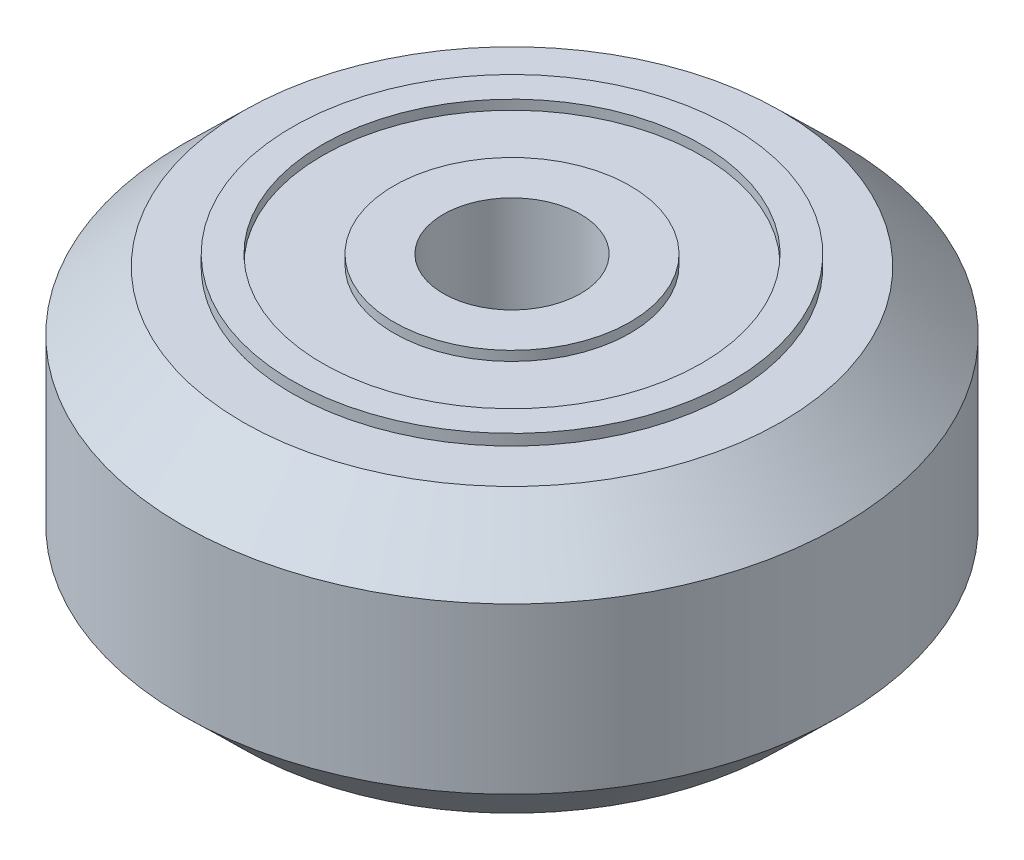
ISO-10303-21;
HEADER;
FILE_DESCRIPTION(('STEP AP214'),'2;1');
FILE_NAME('part.step','',(''),(''),'','','');
FILE_SCHEMA(('AUTOMOTIVE_DESIGN { 1 0 10303 214 1 1 1 1 }'));
ENDSEC;
DATA;
#1=APPLICATION_CONTEXT('core data for automotive mechanical design processes');
#2=APPLICATION_PROTOCOL_DEFINITION('international standard','automotive_design',2000,#1);
#3=PRODUCT_CONTEXT('',#1,'mechanical');
#4=PRODUCT('Part','Part','',(#3));
#5=PRODUCT_RELATED_PRODUCT_CATEGORY('part','',(#4));
#6=PRODUCT_DEFINITION_FORMATION('','',#4);
#7=PRODUCT_DEFINITION_CONTEXT('part definition',#1,'design');
#8=PRODUCT_DEFINITION('design','',#6,#7);
#9=PRODUCT_DEFINITION_SHAPE('','',#8);
#10=(LENGTH_UNIT() NAMED_UNIT(*) SI_UNIT(.MILLI.,.METRE.));
#11=(NAMED_UNIT(*) PLANE_ANGLE_UNIT() SI_UNIT($,.RADIAN.));
#12=(NAMED_UNIT(*) SI_UNIT($,.STERADIAN.) SOLID_ANGLE_UNIT());
#13=UNCERTAINTY_MEASURE_WITH_UNIT(LENGTH_MEASURE(1.E-05),#10,'distance_accuracy_value','');
#14=(GEOMETRIC_REPRESENTATION_CONTEXT(3) GLOBAL_UNCERTAINTY_ASSIGNED_CONTEXT((#13)) GLOBAL_UNIT_ASSIGNED_CONTEXT((#10,
#11,#12)) REPRESENTATION_CONTEXT('',''));
#15=CARTESIAN_POINT('',(0.,0.,0.));
#16=DIRECTION('',(0.,0.,1.));
#17=DIRECTION('',(1.,0.,0.));
#18=AXIS2_PLACEMENT_3D('',#15,#16,#17);
#19=CARTESIAN_POINT('',(0.,-5.55,-8.));
#20=DIRECTION('',(0.,1.,0.));
#21=DIRECTION('',(1.,0.,0.));
#22=AXIS2_PLACEMENT_3D('',#19,#20,#21);
#23=PLANE('',#22);
#24=CARTESIAN_POINT('',(0.,-5.55,0.));
#25=DIRECTION('',(0.,1.,0.));
#26=DIRECTION('',(1.,0.,0.));
#27=AXIS2_PLACEMENT_3D('',#24,#25,#26);
#28=CIRCLE('',#27,8.);
#29=CARTESIAN_POINT('',(8.,-5.55,0.));
#30=VERTEX_POINT('',#29);
#31=EDGE_CURVE('P0_E54',#30,#30,#28,.T.);
#32=ORIENTED_EDGE('',*,*,#31,.F.);
#33=EDGE_LOOP('',(#32));
#34=FACE_BOUND('',#33,.T.);
#35=CARTESIAN_POINT('',(0.,-5.55,0.));
#36=DIRECTION('',(0.,1.,0.));
#37=DIRECTION('',(1.,0.,0.));
#38=AXIS2_PLACEMENT_3D('',#35,#36,#37);
#39=CIRCLE('',#38,6.9);
#40=CARTESIAN_POINT('',(6.9,-5.55,0.));
#41=VERTEX_POINT('',#40);
#42=EDGE_CURVE('P0_E9',#41,#41,#39,.T.);
#43=ORIENTED_EDGE('',*,*,#42,.T.);
#44=EDGE_LOOP('',(#43));
#45=FACE_BOUND('',#44,.T.);
#46=ADVANCED_FACE('P0_F14',(#34,#45),#23,.F.);
#47=CARTESIAN_POINT('',(0.,8.97867383512545,0.));
#48=DIRECTION('',(0.,1.,0.));
#49=DIRECTION('',(1.,0.,0.));
#50=AXIS2_PLACEMENT_3D('',#47,#48,#49);
#51=CYLINDRICAL_SURFACE('',#50,6.9);
#52=ORIENTED_EDGE('',*,*,#42,.F.);
#53=EDGE_LOOP('',(#52));
#54=FACE_BOUND('',#53,.T.);
#55=CARTESIAN_POINT('',(0.,-5.2,0.));
#56=DIRECTION('',(0.,1.,0.));
#57=DIRECTION('',(1.,0.,0.));
#58=AXIS2_PLACEMENT_3D('',#55,#56,#57);
#59=CIRCLE('',#58,6.9);
#60=CARTESIAN_POINT('',(6.9,-5.2,0.));
#61=VERTEX_POINT('',#60);
#62=EDGE_CURVE('P0_E20',#61,#61,#59,.T.);
#63=ORIENTED_EDGE('',*,*,#62,.T.);
#64=EDGE_LOOP('',(#63));
#65=FACE_BOUND('',#64,.T.);
#66=ADVANCED_FACE('P0_F61',(#54,#65),#51,.F.);
#67=CARTESIAN_POINT('',(0.,-5.2,-6.9));
#68=DIRECTION('',(0.,1.,0.));
#69=DIRECTION('',(1.,0.,0.));
#70=AXIS2_PLACEMENT_3D('',#67,#68,#69);
#71=PLANE('',#70);
#72=ORIENTED_EDGE('',*,*,#62,.F.);
#73=EDGE_LOOP('',(#72));
#74=FACE_BOUND('',#73,.T.);
#75=CARTESIAN_POINT('',(0.,-5.2,0.));
#76=DIRECTION('',(0.,1.,0.));
#77=DIRECTION('',(1.,0.,0.));
#78=AXIS2_PLACEMENT_3D('',#75,#76,#77);
#79=CIRCLE('',#78,4.3);
#80=CARTESIAN_POINT('',(4.3,-5.2,0.));
#81=VERTEX_POINT('',#80);
#82=EDGE_CURVE('P0_E24',#81,#81,#79,.T.);
#83=ORIENTED_EDGE('',*,*,#82,.T.);
#84=EDGE_LOOP('',(#83));
#85=FACE_BOUND('',#84,.T.);
#86=ADVANCED_FACE('P0_F66',(#74,#85),#71,.F.);
#87=CARTESIAN_POINT('',(0.,8.97867383512545,0.));
#88=DIRECTION('',(0.,1.,0.));
#89=DIRECTION('',(1.,0.,0.));
#90=AXIS2_PLACEMENT_3D('',#87,#88,#89);
#91=CYLINDRICAL_SURFACE('',#90,4.3);
#92=ORIENTED_EDGE('',*,*,#82,.F.);
#93=EDGE_LOOP('',(#92));
#94=FACE_BOUND('',#93,.T.);
#95=CARTESIAN_POINT('',(0.,-5.55,0.));
#96=DIRECTION('',(0.,1.,0.));
#97=DIRECTION('',(1.,0.,0.));
#98=AXIS2_PLACEMENT_3D('',#95,#96,#97);
#99=CIRCLE('',#98,4.3);
#100=CARTESIAN_POINT('',(4.3,-5.55,0.));
#101=VERTEX_POINT('',#100);
#102=EDGE_CURVE('P0_E28',#101,#101,#99,.T.);
#103=ORIENTED_EDGE('',*,*,#102,.T.);
#104=EDGE_LOOP('',(#103));
#105=FACE_BOUND('',#104,.T.);
#106=ADVANCED_FACE('P0_F71',(#94,#105),#91,.T.);
#107=CARTESIAN_POINT('',(0.,-5.55,-4.3));
#108=DIRECTION('',(0.,1.,0.));
#109=DIRECTION('',(1.,0.,0.));
#110=AXIS2_PLACEMENT_3D('',#107,#108,#109);
#111=PLANE('',#110);
#112=ORIENTED_EDGE('',*,*,#102,.F.);
#113=EDGE_LOOP('',(#112));
#114=FACE_BOUND('',#113,.T.);
#115=CARTESIAN_POINT('',(0.,-5.55,0.));
#116=DIRECTION('',(0.,1.,0.));
#117=DIRECTION('',(1.,0.,0.));
#118=AXIS2_PLACEMENT_3D('',#115,#116,#117);
#119=CIRCLE('',#118,2.5);
#120=CARTESIAN_POINT('',(2.5,-5.55,0.));
#121=VERTEX_POINT('',#120);
#122=EDGE_CURVE('P0_E33',#121,#121,#119,.T.);
#123=ORIENTED_EDGE('',*,*,#122,.T.);
#124=EDGE_LOOP('',(#123));
#125=FACE_BOUND('',#124,.T.);
#126=ADVANCED_FACE('P0_F77',(#114,#125),#111,.F.);
#127=CARTESIAN_POINT('',(0.,8.97867383512545,0.));
#128=DIRECTION('',(0.,1.,0.));
#129=DIRECTION('',(1.,0.,0.));
#130=AXIS2_PLACEMENT_3D('',#127,#128,#129);
#131=CYLINDRICAL_SURFACE('',#130,2.5);
#132=ORIENTED_EDGE('',*,*,#122,.F.);
#133=EDGE_LOOP('',(#132));
#134=FACE_BOUND('',#133,.T.);
#135=CARTESIAN_POINT('',(0.,-0.55,0.));
#136=DIRECTION('',(0.,1.,0.));
#137=DIRECTION('',(1.,0.,0.));
#138=AXIS2_PLACEMENT_3D('',#135,#136,#137);
#139=CIRCLE('',#138,2.5);
#140=CARTESIAN_POINT('',(2.5,-0.55,0.));
#141=VERTEX_POINT('',#140);
#142=EDGE_CURVE('P0_E36',#141,#141,#139,.T.);
#143=ORIENTED_EDGE('',*,*,#142,.T.);
#144=EDGE_LOOP('',(#143));
#145=FACE_BOUND('',#144,.T.);
#146=ADVANCED_FACE('P0_F81',(#134,#145),#131,.F.);
#147=CARTESIAN_POINT('',(0.,-0.549999999999999,-4.3));
#148=DIRECTION('',(0.,-1.,0.));
#149=DIRECTION('',(-1.,0.,0.));
#150=AXIS2_PLACEMENT_3D('',#147,#148,#149);
#151=PLANE('',#150);
#152=ORIENTED_EDGE('',*,*,#142,.F.);
#153=EDGE_LOOP('',(#152));
#154=FACE_BOUND('',#153,.T.);
#155=CARTESIAN_POINT('',(0.,-0.55,0.));
#156=DIRECTION('',(0.,1.,0.));
#157=DIRECTION('',(1.,0.,0.));
#158=AXIS2_PLACEMENT_3D('',#155,#156,#157);
#159=CIRCLE('',#158,4.3);
#160=CARTESIAN_POINT('',(4.3,-0.55,0.));
#161=VERTEX_POINT('',#160);
#162=EDGE_CURVE('P0_E39',#161,#161,#159,.T.);
#163=ORIENTED_EDGE('',*,*,#162,.T.);
#164=EDGE_LOOP('',(#163));
#165=FACE_BOUND('',#164,.T.);
#166=ADVANCED_FACE('P0_F85',(#154,#165),#151,.F.);
#167=CARTESIAN_POINT('',(0.,8.97867383512545,0.));
#168=DIRECTION('',(0.,1.,0.));
#169=DIRECTION('',(1.,0.,0.));
#170=AXIS2_PLACEMENT_3D('',#167,#168,#169);
#171=CYLINDRICAL_SURFACE('',#170,4.3);
#172=ORIENTED_EDGE('',*,*,#162,.F.);
#173=EDGE_LOOP('',(#172));
#174=FACE_BOUND('',#173,.T.);
#175=CARTESIAN_POINT('',(0.,-0.9,0.));
#176=DIRECTION('',(0.,1.,0.));
#177=DIRECTION('',(1.,0.,0.));
#178=AXIS2_PLACEMENT_3D('',#175,#176,#177);
#179=CIRCLE('',#178,4.3);
#180=CARTESIAN_POINT('',(4.3,-0.9,0.));
#181=VERTEX_POINT('',#180);
#182=EDGE_CURVE('P0_E42',#181,#181,#179,.T.);
#183=ORIENTED_EDGE('',*,*,#182,.T.);
#184=EDGE_LOOP('',(#183));
#185=FACE_BOUND('',#184,.T.);
#186=ADVANCED_FACE('P0_F89',(#174,#185),#171,.T.);
#187=CARTESIAN_POINT('',(0.,-0.900000000000001,-6.9));
#188=DIRECTION('',(0.,-1.,0.));
#189=DIRECTION('',(-1.,0.,0.));
#190=AXIS2_PLACEMENT_3D('',#187,#188,#189);
#191=PLANE('',#190);
#192=ORIENTED_EDGE('',*,*,#182,.F.);
#193=EDGE_LOOP('',(#192));
#194=FACE_BOUND('',#193,.T.);
#195=CARTESIAN_POINT('',(0.,-0.9,0.));
#196=DIRECTION('',(0.,1.,0.));
#197=DIRECTION('',(1.,0.,0.));
#198=AXIS2_PLACEMENT_3D('',#195,#196,#197);
#199=CIRCLE('',#198,6.9);
#200=CARTESIAN_POINT('',(6.9,-0.9,0.));
#201=VERTEX_POINT('',#200);
#202=EDGE_CURVE('P0_E45',#201,#201,#199,.T.);
#203=ORIENTED_EDGE('',*,*,#202,.T.);
#204=EDGE_LOOP('',(#203));
#205=FACE_BOUND('',#204,.T.);
#206=ADVANCED_FACE('P0_F93',(#194,#205),#191,.F.);
#207=CARTESIAN_POINT('',(0.,8.97867383512545,0.));
#208=DIRECTION('',(0.,1.,0.));
#209=DIRECTION('',(1.,0.,0.));
#210=AXIS2_PLACEMENT_3D('',#207,#208,#209);
#211=CYLINDRICAL_SURFACE('',#210,6.9);
#212=ORIENTED_EDGE('',*,*,#202,.F.);
#213=EDGE_LOOP('',(#212));
#214=FACE_BOUND('',#213,.T.);
#215=CARTESIAN_POINT('',(0.,-0.55,0.));
#216=DIRECTION('',(0.,1.,0.));
#217=DIRECTION('',(1.,0.,0.));
#218=AXIS2_PLACEMENT_3D('',#215,#216,#217);
#219=CIRCLE('',#218,6.9);
#220=CARTESIAN_POINT('',(6.9,-0.55,0.));
#221=VERTEX_POINT('',#220);
#222=EDGE_CURVE('P0_E48',#221,#221,#219,.T.);
#223=ORIENTED_EDGE('',*,*,#222,.T.);
#224=EDGE_LOOP('',(#223));
#225=FACE_BOUND('',#224,.T.);
#226=ADVANCED_FACE('P0_F97',(#214,#225),#211,.F.);
#227=CARTESIAN_POINT('',(0.,-0.55,-8.));
#228=DIRECTION('',(0.,-1.,0.));
#229=DIRECTION('',(-1.,0.,0.));
#230=AXIS2_PLACEMENT_3D('',#227,#228,#229);
#231=PLANE('',#230);
#232=ORIENTED_EDGE('',*,*,#222,.F.);
#233=EDGE_LOOP('',(#232));
#234=FACE_BOUND('',#233,.T.);
#235=CARTESIAN_POINT('',(0.,-0.55,0.));
#236=DIRECTION('',(0.,1.,0.));
#237=DIRECTION('',(1.,0.,0.));
#238=AXIS2_PLACEMENT_3D('',#235,#236,#237);
#239=CIRCLE('',#238,8.);
#240=CARTESIAN_POINT('',(8.,-0.55,0.));
#241=VERTEX_POINT('',#240);
#242=EDGE_CURVE('P0_E51',#241,#241,#239,.T.);
#243=ORIENTED_EDGE('',*,*,#242,.T.);
#244=EDGE_LOOP('',(#243));
#245=FACE_BOUND('',#244,.T.);
#246=ADVANCED_FACE('P0_F101',(#234,#245),#231,.F.);
#247=CARTESIAN_POINT('',(0.,8.97867383512545,0.));
#248=DIRECTION('',(0.,1.,0.));
#249=DIRECTION('',(1.,0.,0.));
#250=AXIS2_PLACEMENT_3D('',#247,#248,#249);
#251=CYLINDRICAL_SURFACE('',#250,8.);
#252=ORIENTED_EDGE('',*,*,#242,.F.);
#253=EDGE_LOOP('',(#252));
#254=FACE_BOUND('',#253,.T.);
#255=ORIENTED_EDGE('',*,*,#31,.T.);
#256=EDGE_LOOP('',(#255));
#257=FACE_BOUND('',#256,.T.);
#258=ADVANCED_FACE('P0_F58',(#254,#257),#251,.T.);
#259=CLOSED_SHELL('',(#46,#66,#86,#106,#126,#146,#166,#186,#206,#226,#246,#258));
#260=MANIFOLD_SOLID_BREP('P0_B1',#259);
#261=CARTESIAN_POINT('',(0.,0.55,-8.));
#262=DIRECTION('',(0.,1.,0.));
#263=DIRECTION('',(1.,0.,0.));
#264=AXIS2_PLACEMENT_3D('',#261,#262,#263);
#265=PLANE('',#264);
#266=CARTESIAN_POINT('',(0.,0.55,0.));
#267=DIRECTION('',(0.,1.,0.));
#268=DIRECTION('',(1.,0.,0.));
#269=AXIS2_PLACEMENT_3D('',#266,#267,#268);
#270=CIRCLE('',#269,8.);
#271=CARTESIAN_POINT('',(8.,0.55,0.));
#272=VERTEX_POINT('',#271);
#273=EDGE_CURVE('P1_E55',#272,#272,#270,.T.);
#274=ORIENTED_EDGE('',*,*,#273,.F.);
#275=EDGE_LOOP('',(#274));
#276=FACE_BOUND('',#275,.T.);
#277=CARTESIAN_POINT('',(0.,0.55,0.));
#278=DIRECTION('',(0.,1.,0.));
#279=DIRECTION('',(1.,0.,0.));
#280=AXIS2_PLACEMENT_3D('',#277,#278,#279);
#281=CIRCLE('',#280,6.9);
#282=CARTESIAN_POINT('',(6.9,0.55,0.));
#283=VERTEX_POINT('',#282);
#284=EDGE_CURVE('P1_E10',#283,#283,#281,.T.);
#285=ORIENTED_EDGE('',*,*,#284,.T.);
#286=EDGE_LOOP('',(#285));
#287=FACE_BOUND('',#286,.T.);
#288=ADVANCED_FACE('P1_F15',(#276,#287),#265,.F.);
#289=CARTESIAN_POINT('',(0.,15.0786738351254,0.));
#290=DIRECTION('',(0.,1.,0.));
#291=DIRECTION('',(1.,0.,0.));
#292=AXIS2_PLACEMENT_3D('',#289,#290,#291);
#293=CYLINDRICAL_SURFACE('',#292,6.9);
#294=ORIENTED_EDGE('',*,*,#284,.F.);
#295=EDGE_LOOP('',(#294));
#296=FACE_BOUND('',#295,.T.);
#297=CARTESIAN_POINT('',(0.,0.9,0.));
#298=DIRECTION('',(0.,1.,0.));
#299=DIRECTION('',(1.,0.,0.));
#300=AXIS2_PLACEMENT_3D('',#297,#298,#299);
#301=CIRCLE('',#300,6.9);
#302=CARTESIAN_POINT('',(6.9,0.9,0.));
#303=VERTEX_POINT('',#302);
#304=EDGE_CURVE('P1_E21',#303,#303,#301,.T.);
#305=ORIENTED_EDGE('',*,*,#304,.T.);
#306=EDGE_LOOP('',(#305));
#307=FACE_BOUND('',#306,.T.);
#308=ADVANCED_FACE('P1_F62',(#296,#307),#293,.F.);
#309=CARTESIAN_POINT('',(0.,0.900000000000001,-6.9));
#310=DIRECTION('',(0.,1.,0.));
#311=DIRECTION('',(1.,0.,0.));
#312=AXIS2_PLACEMENT_3D('',#309,#310,#311);
#313=PLANE('',#312);
#314=ORIENTED_EDGE('',*,*,#304,.F.);
#315=EDGE_LOOP('',(#314));
#316=FACE_BOUND('',#315,.T.);
#317=CARTESIAN_POINT('',(0.,0.9,0.));
#318=DIRECTION('',(0.,1.,0.));
#319=DIRECTION('',(1.,0.,0.));
#320=AXIS2_PLACEMENT_3D('',#317,#318,#319);
#321=CIRCLE('',#320,4.3);
#322=CARTESIAN_POINT('',(4.3,0.9,0.));
#323=VERTEX_POINT('',#322);
#324=EDGE_CURVE('P1_E25',#323,#323,#321,.T.);
#325=ORIENTED_EDGE('',*,*,#324,.T.);
#326=EDGE_LOOP('',(#325));
#327=FACE_BOUND('',#326,.T.);
#328=ADVANCED_FACE('P1_F67',(#316,#327),#313,.F.);
#329=CARTESIAN_POINT('',(0.,15.0786738351254,0.));
#330=DIRECTION('',(0.,1.,0.));
#331=DIRECTION('',(1.,0.,0.));
#332=AXIS2_PLACEMENT_3D('',#329,#330,#331);
#333=CYLINDRICAL_SURFACE('',#332,4.3);
#334=ORIENTED_EDGE('',*,*,#324,.F.);
#335=EDGE_LOOP('',(#334));
#336=FACE_BOUND('',#335,.T.);
#337=CARTESIAN_POINT('',(0.,0.55,0.));
#338=DIRECTION('',(0.,1.,0.));
#339=DIRECTION('',(1.,0.,0.));
#340=AXIS2_PLACEMENT_3D('',#337,#338,#339);
#341=CIRCLE('',#340,4.3);
#342=CARTESIAN_POINT('',(4.3,0.55,0.));
#343=VERTEX_POINT('',#342);
#344=EDGE_CURVE('P1_E29',#343,#343,#341,.T.);
#345=ORIENTED_EDGE('',*,*,#344,.T.);
#346=EDGE_LOOP('',(#345));
#347=FACE_BOUND('',#346,.T.);
#348=ADVANCED_FACE('P1_F72',(#336,#347),#333,.T.);
#349=CARTESIAN_POINT('',(0.,0.549999999999999,-4.3));
#350=DIRECTION('',(0.,1.,0.));
#351=DIRECTION('',(1.,0.,0.));
#352=AXIS2_PLACEMENT_3D('',#349,#350,#351);
#353=PLANE('',#352);
#354=ORIENTED_EDGE('',*,*,#344,.F.);
#355=EDGE_LOOP('',(#354));
#356=FACE_BOUND('',#355,.T.);
#357=CARTESIAN_POINT('',(0.,0.55,0.));
#358=DIRECTION('',(0.,1.,0.));
#359=DIRECTION('',(1.,0.,0.));
#360=AXIS2_PLACEMENT_3D('',#357,#358,#359);
#361=CIRCLE('',#360,2.5);
#362=CARTESIAN_POINT('',(2.5,0.55,0.));
#363=VERTEX_POINT('',#362);
#364=EDGE_CURVE('P1_E34',#363,#363,#361,.T.);
#365=ORIENTED_EDGE('',*,*,#364,.T.);
#366=EDGE_LOOP('',(#365));
#367=FACE_BOUND('',#366,.T.);
#368=ADVANCED_FACE('P1_F78',(#356,#367),#353,.F.);
#369=CARTESIAN_POINT('',(0.,15.0786738351254,0.));
#370=DIRECTION('',(0.,1.,0.));
#371=DIRECTION('',(1.,0.,0.));
#372=AXIS2_PLACEMENT_3D('',#369,#370,#371);
#373=CYLINDRICAL_SURFACE('',#372,2.5);
#374=ORIENTED_EDGE('',*,*,#364,.F.);
#375=EDGE_LOOP('',(#374));
#376=FACE_BOUND('',#375,.T.);
#377=CARTESIAN_POINT('',(0.,5.55,0.));
#378=DIRECTION('',(0.,1.,0.));
#379=DIRECTION('',(1.,0.,0.));
#380=AXIS2_PLACEMENT_3D('',#377,#378,#379);
#381=CIRCLE('',#380,2.5);
#382=CARTESIAN_POINT('',(2.5,5.55,0.));
#383=VERTEX_POINT('',#382);
#384=EDGE_CURVE('P1_E37',#383,#383,#381,.T.);
#385=ORIENTED_EDGE('',*,*,#384,.T.);
#386=EDGE_LOOP('',(#385));
#387=FACE_BOUND('',#386,.T.);
#388=ADVANCED_FACE('P1_F82',(#376,#387),#373,.F.);
#389=CARTESIAN_POINT('',(0.,5.55,-4.3));
#390=DIRECTION('',(0.,-1.,0.));
#391=DIRECTION('',(-1.,0.,0.));
#392=AXIS2_PLACEMENT_3D('',#389,#390,#391);
#393=PLANE('',#392);
#394=ORIENTED_EDGE('',*,*,#384,.F.);
#395=EDGE_LOOP('',(#394));
#396=FACE_BOUND('',#395,.T.);
#397=CARTESIAN_POINT('',(0.,5.55,0.));
#398=DIRECTION('',(0.,1.,0.));
#399=DIRECTION('',(1.,0.,0.));
#400=AXIS2_PLACEMENT_3D('',#397,#398,#399);
#401=CIRCLE('',#400,4.3);
#402=CARTESIAN_POINT('',(4.3,5.55,0.));
#403=VERTEX_POINT('',#402);
#404=EDGE_CURVE('P1_E40',#403,#403,#401,.T.);
#405=ORIENTED_EDGE('',*,*,#404,.T.);
#406=EDGE_LOOP('',(#405));
#407=FACE_BOUND('',#406,.T.);
#408=ADVANCED_FACE('P1_F86',(#396,#407),#393,.F.);
#409=CARTESIAN_POINT('',(0.,15.0786738351254,0.));
#410=DIRECTION('',(0.,1.,0.));
#411=DIRECTION('',(1.,0.,0.));
#412=AXIS2_PLACEMENT_3D('',#409,#410,#411);
#413=CYLINDRICAL_SURFACE('',#412,4.3);
#414=ORIENTED_EDGE('',*,*,#404,.F.);
#415=EDGE_LOOP('',(#414));
#416=FACE_BOUND('',#415,.T.);
#417=CARTESIAN_POINT('',(0.,5.2,0.));
#418=DIRECTION('',(0.,1.,0.));
#419=DIRECTION('',(1.,0.,0.));
#420=AXIS2_PLACEMENT_3D('',#417,#418,#419);
#421=CIRCLE('',#420,4.3);
#422=CARTESIAN_POINT('',(4.3,5.2,0.));
#423=VERTEX_POINT('',#422);
#424=EDGE_CURVE('P1_E43',#423,#423,#421,.T.);
#425=ORIENTED_EDGE('',*,*,#424,.T.);
#426=EDGE_LOOP('',(#425));
#427=FACE_BOUND('',#426,.T.);
#428=ADVANCED_FACE('P1_F90',(#416,#427),#413,.T.);
#429=CARTESIAN_POINT('',(0.,5.2,-6.9));
#430=DIRECTION('',(0.,-1.,0.));
#431=DIRECTION('',(-1.,0.,0.));
#432=AXIS2_PLACEMENT_3D('',#429,#430,#431);
#433=PLANE('',#432);
#434=ORIENTED_EDGE('',*,*,#424,.F.);
#435=EDGE_LOOP('',(#434));
#436=FACE_BOUND('',#435,.T.);
#437=CARTESIAN_POINT('',(0.,5.2,0.));
#438=DIRECTION('',(0.,1.,0.));
#439=DIRECTION('',(1.,0.,0.));
#440=AXIS2_PLACEMENT_3D('',#437,#438,#439);
#441=CIRCLE('',#440,6.9);
#442=CARTESIAN_POINT('',(6.9,5.2,0.));
#443=VERTEX_POINT('',#442);
#444=EDGE_CURVE('P1_E46',#443,#443,#441,.T.);
#445=ORIENTED_EDGE('',*,*,#444,.T.);
#446=EDGE_LOOP('',(#445));
#447=FACE_BOUND('',#446,.T.);
#448=ADVANCED_FACE('P1_F94',(#436,#447),#433,.F.);
#449=CARTESIAN_POINT('',(0.,15.0786738351254,0.));
#450=DIRECTION('',(0.,1.,0.));
#451=DIRECTION('',(1.,0.,0.));
#452=AXIS2_PLACEMENT_3D('',#449,#450,#451);
#453=CYLINDRICAL_SURFACE('',#452,6.9);
#454=ORIENTED_EDGE('',*,*,#444,.F.);
#455=EDGE_LOOP('',(#454));
#456=FACE_BOUND('',#455,.T.);
#457=CARTESIAN_POINT('',(0.,5.55,0.));
#458=DIRECTION('',(0.,1.,0.));
#459=DIRECTION('',(1.,0.,0.));
#460=AXIS2_PLACEMENT_3D('',#457,#458,#459);
#461=CIRCLE('',#460,6.9);
#462=CARTESIAN_POINT('',(6.9,5.55,0.));
#463=VERTEX_POINT('',#462);
#464=EDGE_CURVE('P1_E49',#463,#463,#461,.T.);
#465=ORIENTED_EDGE('',*,*,#464,.T.);
#466=EDGE_LOOP('',(#465));
#467=FACE_BOUND('',#466,.T.);
#468=ADVANCED_FACE('P1_F98',(#456,#467),#453,.F.);
#469=CARTESIAN_POINT('',(0.,5.55,-8.));
#470=DIRECTION('',(0.,-1.,0.));
#471=DIRECTION('',(-1.,0.,0.));
#472=AXIS2_PLACEMENT_3D('',#469,#470,#471);
#473=PLANE('',#472);
#474=ORIENTED_EDGE('',*,*,#464,.F.);
#475=EDGE_LOOP('',(#474));
#476=FACE_BOUND('',#475,.T.);
#477=CARTESIAN_POINT('',(0.,5.55,0.));
#478=DIRECTION('',(0.,1.,0.));
#479=DIRECTION('',(1.,0.,0.));
#480=AXIS2_PLACEMENT_3D('',#477,#478,#479);
#481=CIRCLE('',#480,8.);
#482=CARTESIAN_POINT('',(8.,5.55,0.));
#483=VERTEX_POINT('',#482);
#484=EDGE_CURVE('P1_E52',#483,#483,#481,.T.);
#485=ORIENTED_EDGE('',*,*,#484,.T.);
#486=EDGE_LOOP('',(#485));
#487=FACE_BOUND('',#486,.T.);
#488=ADVANCED_FACE('P1_F102',(#476,#487),#473,.F.);
#489=CARTESIAN_POINT('',(0.,15.0786738351254,0.));
#490=DIRECTION('',(0.,1.,0.));
#491=DIRECTION('',(1.,0.,0.));
#492=AXIS2_PLACEMENT_3D('',#489,#490,#491);
#493=CYLINDRICAL_SURFACE('',#492,8.);
#494=ORIENTED_EDGE('',*,*,#484,.F.);
#495=EDGE_LOOP('',(#494));
#496=FACE_BOUND('',#495,.T.);
#497=ORIENTED_EDGE('',*,*,#273,.T.);
#498=EDGE_LOOP('',(#497));
#499=FACE_BOUND('',#498,.T.);
#500=ADVANCED_FACE('P1_F59',(#496,#499),#493,.T.);
#501=CLOSED_SHELL('',(#288,#308,#328,#348,#368,#388,#408,#428,#448,#468,#488,#500));
#502=MANIFOLD_SOLID_BREP('P1_B1',#501);
#503=CARTESIAN_POINT('',(8.,0.55,0.));
#504=DIRECTION('',(0.,1.,0.));
#505=DIRECTION('',(1.,0.,0.));
#506=AXIS2_PLACEMENT_3D('',#503,#504,#505);
#507=PLANE('',#506);
#508=CARTESIAN_POINT('',(0.,0.55,0.));
#509=DIRECTION('',(0.,-1.,0.));
#510=DIRECTION('',(1.,0.,0.));
#511=AXIS2_PLACEMENT_3D('',#508,#509,#510);
#512=CIRCLE('',#511,8.);
#513=CARTESIAN_POINT('',(8.,0.55,0.));
#514=VERTEX_POINT('',#513);
#515=CARTESIAN_POINT('',(-8.,0.55,0.));
#516=VERTEX_POINT('',#515);
#517=EDGE_CURVE('P2_E40',#514,#516,#512,.T.);
#518=ORIENTED_EDGE('',*,*,#517,.F.);
#519=CARTESIAN_POINT('',(0.,0.55,0.));
#520=DIRECTION('',(0.,-1.,0.));
#521=DIRECTION('',(1.,0.,0.));
#522=AXIS2_PLACEMENT_3D('',#519,#520,#521);
#523=CIRCLE('',#522,8.);
#524=EDGE_CURVE('P2_E165',#516,#514,#523,.T.);
#525=ORIENTED_EDGE('',*,*,#524,.F.);
#526=EDGE_LOOP('',(#518,#525));
#527=FACE_BOUND('',#526,.T.);
#528=CARTESIAN_POINT('',(0.,0.55,0.));
#529=DIRECTION('',(0.,-1.,0.));
#530=DIRECTION('',(1.,0.,0.));
#531=AXIS2_PLACEMENT_3D('',#528,#529,#530);
#532=CIRCLE('',#531,7.);
#533=CARTESIAN_POINT('',(7.,0.55,0.));
#534=VERTEX_POINT('',#533);
#535=CARTESIAN_POINT('',(-7.,0.55,0.));
#536=VERTEX_POINT('',#535);
#537=EDGE_CURVE('P2_E11',#534,#536,#532,.T.);
#538=ORIENTED_EDGE('',*,*,#537,.T.);
#539=CARTESIAN_POINT('',(0.,0.55,0.));
#540=DIRECTION('',(0.,-1.,0.));
#541=DIRECTION('',(1.,0.,0.));
#542=AXIS2_PLACEMENT_3D('',#539,#540,#541);
#543=CIRCLE('',#542,7.);
#544=EDGE_CURVE('P2_E27',#536,#534,#543,.T.);
#545=ORIENTED_EDGE('',*,*,#544,.T.);
#546=EDGE_LOOP('',(#538,#545));
#547=FACE_BOUND('',#546,.T.);
#548=ADVANCED_FACE('P2_F17',(#527,#547),#507,.T.);
#549=CARTESIAN_POINT('',(0.,2.85,0.));
#550=DIRECTION('',(0.,-1.,0.));
#551=DIRECTION('',(1.,0.,0.));
#552=AXIS2_PLACEMENT_3D('',#549,#550,#551);
#553=CYLINDRICAL_SURFACE('',#552,8.);
#554=ORIENTED_EDGE('',*,*,#517,.T.);
#555=DIRECTION('',(0.,1.,0.));
#556=VECTOR('',#555,1.);
#557=CARTESIAN_POINT('',(-8.,2.85,0.));
#558=LINE('',#557,#556);
#559=CARTESIAN_POINT('',(-8.,5.15,0.));
#560=VERTEX_POINT('',#559);
#561=EDGE_CURVE('P2_E168',#516,#560,#558,.T.);
#562=ORIENTED_EDGE('',*,*,#561,.T.);
#563=CARTESIAN_POINT('',(0.,5.15,0.));
#564=DIRECTION('',(0.,-1.,0.));
#565=DIRECTION('',(1.,0.,0.));
#566=AXIS2_PLACEMENT_3D('',#563,#564,#565);
#567=CIRCLE('',#566,8.);
#568=CARTESIAN_POINT('',(8.,5.15,0.));
#569=VERTEX_POINT('',#568);
#570=EDGE_CURVE('P2_E163',#569,#560,#567,.T.);
#571=ORIENTED_EDGE('',*,*,#570,.F.);
#572=CARTESIAN_POINT('',(0.,5.15,0.));
#573=DIRECTION('',(0.,-1.,0.));
#574=DIRECTION('',(1.,0.,0.));
#575=AXIS2_PLACEMENT_3D('',#572,#573,#574);
#576=CIRCLE('',#575,8.);
#577=EDGE_CURVE('P2_E166',#560,#569,#576,.T.);
#578=ORIENTED_EDGE('',*,*,#577,.F.);
#579=ORIENTED_EDGE('',*,*,#561,.F.);
#580=ORIENTED_EDGE('',*,*,#524,.T.);
#581=EDGE_LOOP('',(#554,#562,#571,#578,#579,#580));
#582=FACE_BOUND('',#581,.T.);
#583=ADVANCED_FACE('P2_F212',(#582),#553,.F.);
#584=CARTESIAN_POINT('',(9.8,5.15,0.));
#585=DIRECTION('',(0.,1.,0.));
#586=DIRECTION('',(1.,0.,0.));
#587=AXIS2_PLACEMENT_3D('',#584,#585,#586);
#588=PLANE('',#587);
#589=CARTESIAN_POINT('',(0.,5.15,0.));
#590=DIRECTION('',(0.,-1.,0.));
#591=DIRECTION('',(1.,0.,0.));
#592=AXIS2_PLACEMENT_3D('',#589,#590,#591);
#593=CIRCLE('',#592,9.8);
#594=CARTESIAN_POINT('',(9.8,5.15,0.));
#595=VERTEX_POINT('',#594);
#596=CARTESIAN_POINT('',(-9.8,5.15,0.));
#597=VERTEX_POINT('',#596);
#598=EDGE_CURVE('P2_E151',#595,#597,#593,.T.);
#599=ORIENTED_EDGE('',*,*,#598,.F.);
#600=CARTESIAN_POINT('',(0.,5.15,0.));
#601=DIRECTION('',(0.,-1.,0.));
#602=DIRECTION('',(1.,0.,0.));
#603=AXIS2_PLACEMENT_3D('',#600,#601,#602);
#604=CIRCLE('',#603,9.8);
#605=EDGE_CURVE('P2_E154',#597,#595,#604,.T.);
#606=ORIENTED_EDGE('',*,*,#605,.F.);
#607=EDGE_LOOP('',(#599,#606));
#608=FACE_BOUND('',#607,.T.);
#609=ORIENTED_EDGE('',*,*,#570,.T.);
#610=ORIENTED_EDGE('',*,*,#577,.T.);
#611=EDGE_LOOP('',(#609,#610));
#612=FACE_BOUND('',#611,.T.);
#613=ADVANCED_FACE('P2_F215',(#608,#612),#588,.T.);
#614=CARTESIAN_POINT('',(0.,4.075,0.));
#615=DIRECTION('',(0.,-1.,0.));
#616=DIRECTION('',(1.,0.,0.));
#617=AXIS2_PLACEMENT_3D('',#614,#615,#616);
#618=CONICAL_SURFACE('',#617,10.9,0.796891910112479);
#619=CARTESIAN_POINT('',(0.,3.,0.));
#620=DIRECTION('',(0.,-1.,0.));
#621=DIRECTION('',(1.,0.,0.));
#622=AXIS2_PLACEMENT_3D('',#619,#620,#621);
#623=CIRCLE('',#622,12.);
#624=CARTESIAN_POINT('',(12.,3.,0.));
#625=VERTEX_POINT('',#624);
#626=CARTESIAN_POINT('',(-12.,3.,0.));
#627=VERTEX_POINT('',#626);
#628=EDGE_CURVE('P2_E201',#625,#627,#623,.T.);
#629=ORIENTED_EDGE('',*,*,#628,.F.);
#630=CARTESIAN_POINT('',(0.,3.,0.));
#631=DIRECTION('',(0.,-1.,0.));
#632=DIRECTION('',(1.,0.,0.));
#633=AXIS2_PLACEMENT_3D('',#630,#631,#632);
#634=CIRCLE('',#633,12.);
#635=EDGE_CURVE('P2_E20',#627,#625,#634,.T.);
#636=ORIENTED_EDGE('',*,*,#635,.F.);
#637=DIRECTION('',(0.715187202401024,0.698932947801001,0.));
#638=VECTOR('',#637,1.);
#639=CARTESIAN_POINT('',(-10.9,4.075,0.));
#640=LINE('',#639,#638);
#641=EDGE_CURVE('P2_E175',#627,#597,#640,.T.);
#642=ORIENTED_EDGE('',*,*,#641,.T.);
#643=ORIENTED_EDGE('',*,*,#605,.T.);
#644=ORIENTED_EDGE('',*,*,#598,.T.);
#645=ORIENTED_EDGE('',*,*,#641,.F.);
#646=EDGE_LOOP('',(#629,#636,#642,#643,#644,#645));
#647=FACE_BOUND('',#646,.T.);
#648=ADVANCED_FACE('P2_F217',(#647),#618,.T.);
#649=CARTESIAN_POINT('',(0.,0.,0.));
#650=DIRECTION('',(0.,-1.,0.));
#651=DIRECTION('',(1.,0.,0.));
#652=AXIS2_PLACEMENT_3D('',#649,#650,#651);
#653=CYLINDRICAL_SURFACE('',#652,12.);
#654=CARTESIAN_POINT('',(0.,-3.,0.));
#655=DIRECTION('',(0.,-1.,0.));
#656=DIRECTION('',(1.,0.,0.));
#657=AXIS2_PLACEMENT_3D('',#654,#655,#656);
#658=CIRCLE('',#657,12.);
#659=CARTESIAN_POINT('',(12.,-3.,0.));
#660=VERTEX_POINT('',#659);
#661=CARTESIAN_POINT('',(-12.,-3.,0.));
#662=VERTEX_POINT('',#661);
#663=EDGE_CURVE('P2_E156',#660,#662,#658,.T.);
#664=ORIENTED_EDGE('',*,*,#663,.F.);
#665=CARTESIAN_POINT('',(0.,-3.,0.));
#666=DIRECTION('',(0.,-1.,0.));
#667=DIRECTION('',(1.,0.,0.));
#668=AXIS2_PLACEMENT_3D('',#665,#666,#667);
#669=CIRCLE('',#668,12.);
#670=EDGE_CURVE('P2_E159',#662,#660,#669,.T.);
#671=ORIENTED_EDGE('',*,*,#670,.F.);
#672=DIRECTION('',(0.,1.,0.));
#673=VECTOR('',#672,1.);
#674=CARTESIAN_POINT('',(-12.,0.,0.));
#675=LINE('',#674,#673);
#676=EDGE_CURVE('P2_E155',#662,#627,#675,.T.);
#677=ORIENTED_EDGE('',*,*,#676,.T.);
#678=ORIENTED_EDGE('',*,*,#635,.T.);
#679=ORIENTED_EDGE('',*,*,#628,.T.);
#680=ORIENTED_EDGE('',*,*,#676,.F.);
#681=EDGE_LOOP('',(#664,#671,#677,#678,#679,#680));
#682=FACE_BOUND('',#681,.T.);
#683=ADVANCED_FACE('P2_F225',(#682),#653,.T.);
#684=CARTESIAN_POINT('',(0.,-4.075,0.));
#685=DIRECTION('',(0.,1.,0.));
#686=DIRECTION('',(1.,0.,0.));
#687=AXIS2_PLACEMENT_3D('',#684,#685,#686);
#688=CONICAL_SURFACE('',#687,10.9,0.796891910112479);
#689=CARTESIAN_POINT('',(0.,-5.15,0.));
#690=DIRECTION('',(0.,-1.,0.));
#691=DIRECTION('',(1.,0.,0.));
#692=AXIS2_PLACEMENT_3D('',#689,#690,#691);
#693=CIRCLE('',#692,9.8);
#694=CARTESIAN_POINT('',(9.8,-5.15,0.));
#695=VERTEX_POINT('',#694);
#696=CARTESIAN_POINT('',(-9.8,-5.15,0.));
#697=VERTEX_POINT('',#696);
#698=EDGE_CURVE('P2_E119',#695,#697,#693,.T.);
#699=ORIENTED_EDGE('',*,*,#698,.F.);
#700=CARTESIAN_POINT('',(0.,-5.15,0.));
#701=DIRECTION('',(0.,-1.,0.));
#702=DIRECTION('',(1.,0.,0.));
#703=AXIS2_PLACEMENT_3D('',#700,#701,#702);
#704=CIRCLE('',#703,9.8);
#705=EDGE_CURVE('P2_E123',#697,#695,#704,.T.);
#706=ORIENTED_EDGE('',*,*,#705,.F.);
#707=DIRECTION('',(-0.715187202401024,0.698932947801001,0.));
#708=VECTOR('',#707,1.);
#709=CARTESIAN_POINT('',(-10.9,-4.075,0.));
#710=LINE('',#709,#708);
#711=EDGE_CURVE('P2_E179',#697,#662,#710,.T.);
#712=ORIENTED_EDGE('',*,*,#711,.T.);
#713=ORIENTED_EDGE('',*,*,#670,.T.);
#714=ORIENTED_EDGE('',*,*,#663,.T.);
#715=ORIENTED_EDGE('',*,*,#711,.F.);
#716=EDGE_LOOP('',(#699,#706,#712,#713,#714,#715));
#717=FACE_BOUND('',#716,.T.);
#718=ADVANCED_FACE('P2_F251',(#717),#688,.T.);
#719=CARTESIAN_POINT('',(8.,-5.15,0.));
#720=DIRECTION('',(0.,-1.,0.));
#721=DIRECTION('',(0.,0.,-1.));
#722=AXIS2_PLACEMENT_3D('',#719,#720,#721);
#723=PLANE('',#722);
#724=ORIENTED_EDGE('',*,*,#698,.T.);
#725=ORIENTED_EDGE('',*,*,#705,.T.);
#726=EDGE_LOOP('',(#724,#725));
#727=FACE_BOUND('',#726,.T.);
#728=CARTESIAN_POINT('',(0.,-5.15,0.));
#729=DIRECTION('',(0.,-1.,0.));
#730=DIRECTION('',(1.,0.,0.));
#731=AXIS2_PLACEMENT_3D('',#728,#729,#730);
#732=CIRCLE('',#731,8.);
#733=CARTESIAN_POINT('',(8.,-5.15,0.));
#734=VERTEX_POINT('',#733);
#735=CARTESIAN_POINT('',(-8.,-5.15,0.));
#736=VERTEX_POINT('',#735);
#737=EDGE_CURVE('P2_E129',#734,#736,#732,.T.);
#738=ORIENTED_EDGE('',*,*,#737,.F.);
#739=CARTESIAN_POINT('',(0.,-5.15,0.));
#740=DIRECTION('',(0.,-1.,0.));
#741=DIRECTION('',(1.,0.,0.));
#742=AXIS2_PLACEMENT_3D('',#739,#740,#741);
#743=CIRCLE('',#742,8.);
#744=EDGE_CURVE('P2_E132',#736,#734,#743,.T.);
#745=ORIENTED_EDGE('',*,*,#744,.F.);
#746=EDGE_LOOP('',(#738,#745));
#747=FACE_BOUND('',#746,.T.);
#748=ADVANCED_FACE('P2_F131',(#727,#747),#723,.T.);
#749=CARTESIAN_POINT('',(0.,-2.85,0.));
#750=DIRECTION('',(0.,-1.,0.));
#751=DIRECTION('',(1.,0.,0.));
#752=AXIS2_PLACEMENT_3D('',#749,#750,#751);
#753=CYLINDRICAL_SURFACE('',#752,8.);
#754=ORIENTED_EDGE('',*,*,#737,.T.);
#755=DIRECTION('',(0.,1.,0.));
#756=VECTOR('',#755,1.);
#757=CARTESIAN_POINT('',(-8.,-2.85,0.));
#758=LINE('',#757,#756);
#759=CARTESIAN_POINT('',(-8.,-0.55,0.));
#760=VERTEX_POINT('',#759);
#761=EDGE_CURVE('P2_E135',#736,#760,#758,.T.);
#762=ORIENTED_EDGE('',*,*,#761,.T.);
#763=CARTESIAN_POINT('',(0.,-0.55,0.));
#764=DIRECTION('',(0.,-1.,0.));
#765=DIRECTION('',(1.,0.,0.));
#766=AXIS2_PLACEMENT_3D('',#763,#764,#765);
#767=CIRCLE('',#766,8.);
#768=CARTESIAN_POINT('',(8.,-0.55,0.));
#769=VERTEX_POINT('',#768);
#770=EDGE_CURVE('P2_E103',#769,#760,#767,.T.);
#771=ORIENTED_EDGE('',*,*,#770,.F.);
#772=CARTESIAN_POINT('',(0.,-0.55,0.));
#773=DIRECTION('',(0.,-1.,0.));
#774=DIRECTION('',(1.,0.,0.));
#775=AXIS2_PLACEMENT_3D('',#772,#773,#774);
#776=CIRCLE('',#775,8.);
#777=EDGE_CURVE('P2_E146',#760,#769,#776,.T.);
#778=ORIENTED_EDGE('',*,*,#777,.F.);
#779=ORIENTED_EDGE('',*,*,#761,.F.);
#780=ORIENTED_EDGE('',*,*,#744,.T.);
#781=EDGE_LOOP('',(#754,#762,#771,#778,#779,#780));
#782=FACE_BOUND('',#781,.T.);
#783=ADVANCED_FACE('P2_F137',(#782),#753,.F.);
#784=CARTESIAN_POINT('',(7.,-0.55,0.));
#785=DIRECTION('',(0.,-1.,0.));
#786=DIRECTION('',(0.,0.,-1.));
#787=AXIS2_PLACEMENT_3D('',#784,#785,#786);
#788=PLANE('',#787);
#789=ORIENTED_EDGE('',*,*,#770,.T.);
#790=ORIENTED_EDGE('',*,*,#777,.T.);
#791=EDGE_LOOP('',(#789,#790));
#792=FACE_BOUND('',#791,.T.);
#793=CARTESIAN_POINT('',(0.,-0.55,0.));
#794=DIRECTION('',(0.,-1.,0.));
#795=DIRECTION('',(1.,0.,0.));
#796=AXIS2_PLACEMENT_3D('',#793,#794,#795);
#797=CIRCLE('',#796,7.);
#798=CARTESIAN_POINT('',(7.,-0.55,0.));
#799=VERTEX_POINT('',#798);
#800=CARTESIAN_POINT('',(-7.,-0.55,0.));
#801=VERTEX_POINT('',#800);
#802=EDGE_CURVE('P2_E188',#799,#801,#797,.T.);
#803=ORIENTED_EDGE('',*,*,#802,.F.);
#804=CARTESIAN_POINT('',(0.,-0.55,0.));
#805=DIRECTION('',(0.,-1.,0.));
#806=DIRECTION('',(1.,0.,0.));
#807=AXIS2_PLACEMENT_3D('',#804,#805,#806);
#808=CIRCLE('',#807,7.);
#809=EDGE_CURVE('P2_E193',#801,#799,#808,.T.);
#810=ORIENTED_EDGE('',*,*,#809,.F.);
#811=EDGE_LOOP('',(#803,#810));
#812=FACE_BOUND('',#811,.T.);
#813=ADVANCED_FACE('P2_F240',(#792,#812),#788,.T.);
#814=CARTESIAN_POINT('',(0.,0.,0.));
#815=DIRECTION('',(0.,-1.,0.));
#816=DIRECTION('',(1.,0.,0.));
#817=AXIS2_PLACEMENT_3D('',#814,#815,#816);
#818=CYLINDRICAL_SURFACE('',#817,7.);
#819=ORIENTED_EDGE('',*,*,#802,.T.);
#820=DIRECTION('',(0.,1.,0.));
#821=VECTOR('',#820,1.);
#822=CARTESIAN_POINT('',(-7.,0.,0.));
#823=LINE('',#822,#821);
#824=EDGE_CURVE('P2_E192',#801,#536,#823,.T.);
#825=ORIENTED_EDGE('',*,*,#824,.T.);
#826=ORIENTED_EDGE('',*,*,#537,.F.);
#827=ORIENTED_EDGE('',*,*,#544,.F.);
#828=ORIENTED_EDGE('',*,*,#824,.F.);
#829=ORIENTED_EDGE('',*,*,#809,.T.);
#830=EDGE_LOOP('',(#819,#825,#826,#827,#828,#829));
#831=FACE_BOUND('',#830,.T.);
#832=ADVANCED_FACE('P2_F238',(#831),#818,.F.);
#833=CLOSED_SHELL('',(#548,#583,#613,#648,#683,#718,#748,#783,#813,#832));
#834=MANIFOLD_SOLID_BREP('P2_B1',#833);
#835=CARTESIAN_POINT('',(0.,0.500000000000001,0.));
#836=DIRECTION('',(0.,-1.,0.));
#837=DIRECTION('',(-1.,0.,0.));
#838=AXIS2_PLACEMENT_3D('',#835,#836,#837);
#839=CYLINDRICAL_SURFACE('',#838,2.6);
#840=CARTESIAN_POINT('',(0.,0.500000000000001,0.));
#841=DIRECTION('',(0.,-1.,0.));
#842=DIRECTION('',(-1.,0.,0.));
#843=AXIS2_PLACEMENT_3D('',#840,#841,#842);
#844=CIRCLE('',#843,2.6);
#845=CARTESIAN_POINT('',(2.6,0.500000000000001,0.));
#846=VERTEX_POINT('',#845);
#847=EDGE_CURVE('P3_E39',#846,#846,#844,.T.);
#848=ORIENTED_EDGE('',*,*,#847,.F.);
#849=DIRECTION('',(0.,-1.,0.));
#850=VECTOR('',#849,1.);
#851=CARTESIAN_POINT('',(2.6,0.500000000000001,0.));
#852=LINE('',#851,#850);
#853=CARTESIAN_POINT('',(2.6,-0.499999999999999,0.));
#854=VERTEX_POINT('',#853);
#855=EDGE_CURVE('P3_E11',#846,#854,#852,.T.);
#856=ORIENTED_EDGE('',*,*,#855,.T.);
#857=CARTESIAN_POINT('',(0.,-0.499999999999999,0.));
#858=DIRECTION('',(0.,1.,0.));
#859=DIRECTION('',(-1.,0.,0.));
#860=AXIS2_PLACEMENT_3D('',#857,#858,#859);
#861=CIRCLE('',#860,2.6);
#862=EDGE_CURVE('P3_E69',#854,#854,#861,.T.);
#863=ORIENTED_EDGE('',*,*,#862,.F.);
#864=ORIENTED_EDGE('',*,*,#855,.F.);
#865=EDGE_LOOP('',(#848,#856,#863,#864));
#866=FACE_BOUND('',#865,.T.);
#867=ADVANCED_FACE('P3_F17',(#866),#839,.F.);
#868=CARTESIAN_POINT('',(0.,0.500000000000001,0.));
#869=DIRECTION('',(0.,-1.,0.));
#870=DIRECTION('',(-1.,0.,0.));
#871=AXIS2_PLACEMENT_3D('',#868,#869,#870);
#872=CYLINDRICAL_SURFACE('',#871,5.);
#873=CARTESIAN_POINT('',(0.,-0.499999999999999,0.));
#874=DIRECTION('',(0.,-1.,0.));
#875=DIRECTION('',(-1.,0.,0.));
#876=AXIS2_PLACEMENT_3D('',#873,#874,#875);
#877=CIRCLE('',#876,5.);
#878=CARTESIAN_POINT('',(5.,-0.499999999999999,0.));
#879=VERTEX_POINT('',#878);
#880=EDGE_CURVE('P3_E52',#879,#879,#877,.T.);
#881=ORIENTED_EDGE('',*,*,#880,.F.);
#882=DIRECTION('',(0.,1.,0.));
#883=VECTOR('',#882,1.);
#884=CARTESIAN_POINT('',(5.,0.500000000000001,0.));
#885=LINE('',#884,#883);
#886=CARTESIAN_POINT('',(5.,0.500000000000001,0.));
#887=VERTEX_POINT('',#886);
#888=EDGE_CURVE('P3_E21',#879,#887,#885,.T.);
#889=ORIENTED_EDGE('',*,*,#888,.T.);
#890=CARTESIAN_POINT('',(0.,0.500000000000001,0.));
#891=DIRECTION('',(0.,1.,0.));
#892=DIRECTION('',(-1.,0.,0.));
#893=AXIS2_PLACEMENT_3D('',#890,#891,#892);
#894=CIRCLE('',#893,5.);
#895=EDGE_CURVE('P3_E57',#887,#887,#894,.T.);
#896=ORIENTED_EDGE('',*,*,#895,.F.);
#897=ORIENTED_EDGE('',*,*,#888,.F.);
#898=EDGE_LOOP('',(#881,#889,#896,#897));
#899=FACE_BOUND('',#898,.T.);
#900=ADVANCED_FACE('P3_F58',(#899),#872,.T.);
#901=CARTESIAN_POINT('',(0.,0.500000000000001,0.));
#902=DIRECTION('',(0.,-1.,0.));
#903=DIRECTION('',(1.,0.,0.));
#904=AXIS2_PLACEMENT_3D('',#901,#902,#903);
#905=PLANE('',#904);
#906=ORIENTED_EDGE('',*,*,#895,.T.);
#907=EDGE_LOOP('',(#906));
#908=FACE_BOUND('',#907,.T.);
#909=ORIENTED_EDGE('',*,*,#847,.T.);
#910=EDGE_LOOP('',(#909));
#911=FACE_BOUND('',#910,.T.);
#912=ADVANCED_FACE('P3_F80',(#908,#911),#905,.F.);
#913=CARTESIAN_POINT('',(0.,-0.499999999999999,0.));
#914=DIRECTION('',(0.,-1.,0.));
#915=DIRECTION('',(1.,0.,0.));
#916=AXIS2_PLACEMENT_3D('',#913,#914,#915);
#917=PLANE('',#916);
#918=ORIENTED_EDGE('',*,*,#880,.T.);
#919=EDGE_LOOP('',(#918));
#920=FACE_BOUND('',#919,.T.);
#921=ORIENTED_EDGE('',*,*,#862,.T.);
#922=EDGE_LOOP('',(#921));
#923=FACE_BOUND('',#922,.T.);
#924=ADVANCED_FACE('P3_F19',(#920,#923),#917,.T.);
#925=CLOSED_SHELL('',(#867,#900,#912,#924));
#926=MANIFOLD_SOLID_BREP('P3_B1',#925);
#927=ADVANCED_BREP_SHAPE_REPRESENTATION('',(#18,#260,#502,#834,#926),#14);
#928=SHAPE_DEFINITION_REPRESENTATION(#9,#927);
ENDSEC;
END-ISO-10303-21;
